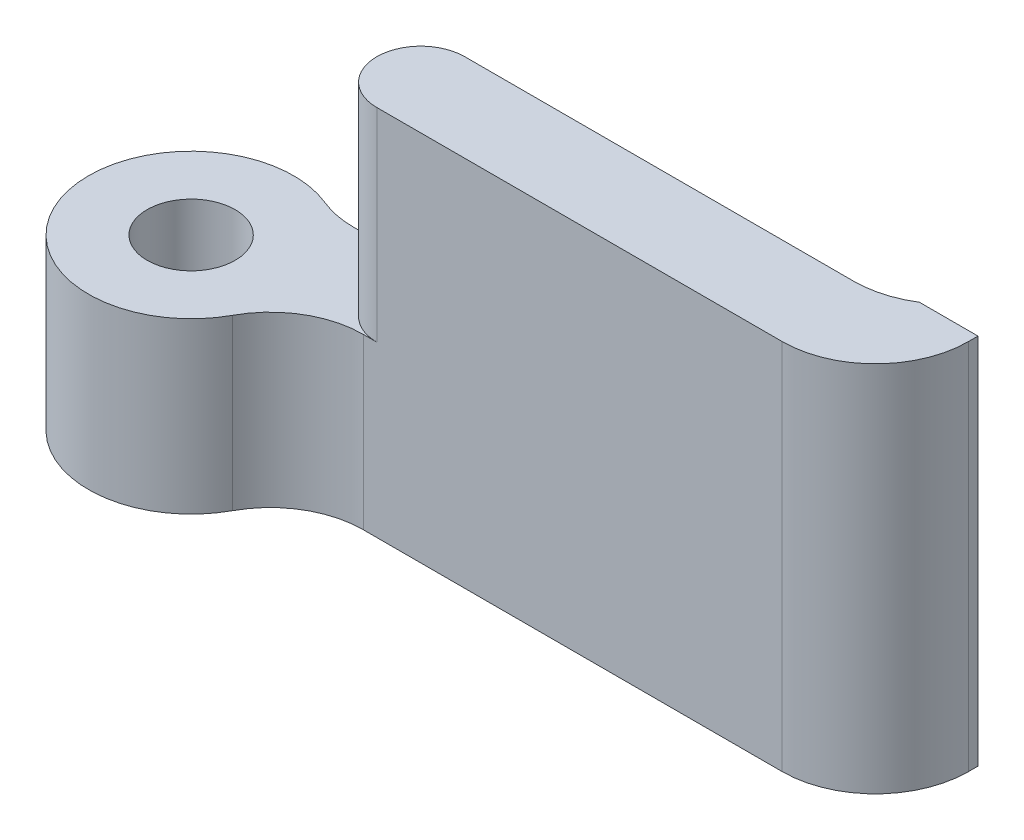
ISO-10303-21;
HEADER;
FILE_DESCRIPTION(('STEP AP214'),'2;1');
FILE_NAME('part.step','',(''),(''),'','','');
FILE_SCHEMA(('AUTOMOTIVE_DESIGN { 1 0 10303 214 1 1 1 1 }'));
ENDSEC;
DATA;
#1=APPLICATION_CONTEXT('core data for automotive mechanical design processes');
#2=APPLICATION_PROTOCOL_DEFINITION('international standard','automotive_design',2000,#1);
#3=PRODUCT_CONTEXT('',#1,'mechanical');
#4=PRODUCT('Part','Part','',(#3));
#5=PRODUCT_RELATED_PRODUCT_CATEGORY('part','',(#4));
#6=PRODUCT_DEFINITION_FORMATION('','',#4);
#7=PRODUCT_DEFINITION_CONTEXT('part definition',#1,'design');
#8=PRODUCT_DEFINITION('design','',#6,#7);
#9=PRODUCT_DEFINITION_SHAPE('','',#8);
#10=(LENGTH_UNIT() NAMED_UNIT(*) SI_UNIT(.MILLI.,.METRE.));
#11=(NAMED_UNIT(*) PLANE_ANGLE_UNIT() SI_UNIT($,.RADIAN.));
#12=(NAMED_UNIT(*) SI_UNIT($,.STERADIAN.) SOLID_ANGLE_UNIT());
#13=UNCERTAINTY_MEASURE_WITH_UNIT(LENGTH_MEASURE(1.E-05),#10,'distance_accuracy_value','');
#14=(GEOMETRIC_REPRESENTATION_CONTEXT(3) GLOBAL_UNCERTAINTY_ASSIGNED_CONTEXT((#13)) GLOBAL_UNIT_ASSIGNED_CONTEXT((#10,
#11,#12)) REPRESENTATION_CONTEXT('',''));
#15=CARTESIAN_POINT('',(0.,0.,0.));
#16=DIRECTION('',(0.,0.,1.));
#17=DIRECTION('',(1.,0.,0.));
#18=AXIS2_PLACEMENT_3D('',#15,#16,#17);
#19=CARTESIAN_POINT('',(-22.0637703059142,12.7,-11.2355470698206));
#20=DIRECTION('',(0.,-1.,0.));
#21=DIRECTION('',(0.,0.,-1.));
#22=AXIS2_PLACEMENT_3D('',#19,#20,#21);
#23=CYLINDRICAL_SURFACE('',#22,3.5);
#24=CARTESIAN_POINT('',(-22.0637703059142,5.77,-11.2355470698206));
#25=DIRECTION('',(0.,-1.,0.));
#26=DIRECTION('',(0.,0.,-1.));
#27=AXIS2_PLACEMENT_3D('',#24,#25,#26);
#28=CIRCLE('',#27,3.5);
#29=CARTESIAN_POINT('',(-18.9850593885621,5.77,-9.57075306233));
#30=VERTEX_POINT('',#29);
#31=CARTESIAN_POINT('',(-20.7346835195554,5.77,-14.4733747851764));
#32=VERTEX_POINT('',#31);
#33=EDGE_CURVE('E174',#30,#32,#28,.T.);
#34=ORIENTED_EDGE('',*,*,#33,.T.);
#35=DIRECTION('',(0.,-1.,0.));
#36=VECTOR('',#35,1.);
#37=CARTESIAN_POINT('',(-20.7346835195554,12.7,-14.4733747851764));
#38=LINE('',#37,#36);
#39=CARTESIAN_POINT('',(-20.7346835195554,0.,-14.4733747851764));
#40=VERTEX_POINT('',#39);
#41=EDGE_CURVE('E210',#32,#40,#38,.T.);
#42=ORIENTED_EDGE('',*,*,#41,.T.);
#43=CARTESIAN_POINT('',(-22.0637703059142,0.,-11.2355470698206));
#44=DIRECTION('',(0.,1.,0.));
#45=DIRECTION('',(0.,0.,1.));
#46=AXIS2_PLACEMENT_3D('',#43,#44,#45);
#47=CIRCLE('',#46,3.5);
#48=CARTESIAN_POINT('',(-18.9850593885621,0.,-9.57075306233));
#49=VERTEX_POINT('',#48);
#50=EDGE_CURVE('E179',#40,#49,#47,.T.);
#51=ORIENTED_EDGE('',*,*,#50,.T.);
#52=DIRECTION('',(0.,-1.,0.));
#53=VECTOR('',#52,1.);
#54=CARTESIAN_POINT('',(-18.9850593885621,12.7,-9.57075306233));
#55=LINE('',#54,#53);
#56=EDGE_CURVE('E208',#49,#30,#55,.F.);
#57=ORIENTED_EDGE('',*,*,#56,.T.);
#58=EDGE_LOOP('',(#34,#42,#51,#57));
#59=FACE_BOUND('',#58,.T.);
#60=ADVANCED_FACE('F35',(#59),#23,.T.);
#61=CARTESIAN_POINT('',(0.,12.7,-11.2355470698207));
#62=DIRECTION('',(0.,0.,-1.));
#63=DIRECTION('',(-1.,0.,0.));
#64=AXIS2_PLACEMENT_3D('',#61,#62,#63);
#65=PLANE('',#64);
#66=DIRECTION('',(1.,0.,0.));
#67=VECTOR('',#66,1.);
#68=CARTESIAN_POINT('',(0.,0.,-11.2355470698207));
#69=LINE('',#68,#67);
#70=CARTESIAN_POINT('',(-16.1922287706784,0.,-11.2355470698206));
#71=VERTEX_POINT('',#70);
#72=CARTESIAN_POINT('',(-1.90855751243395,0.,-11.2355470698207));
#73=VERTEX_POINT('',#72);
#74=EDGE_CURVE('E189',#71,#73,#69,.T.);
#75=ORIENTED_EDGE('',*,*,#74,.T.);
#76=DIRECTION('',(0.,-1.,0.));
#77=VECTOR('',#76,1.);
#78=CARTESIAN_POINT('',(-1.90855751243395,12.7,-11.2355470698207));
#79=LINE('',#78,#77);
#80=CARTESIAN_POINT('',(-1.90855751243395,12.7,-11.2355470698207));
#81=VERTEX_POINT('',#80);
#82=EDGE_CURVE('E204',#73,#81,#79,.F.);
#83=ORIENTED_EDGE('',*,*,#82,.T.);
#84=DIRECTION('',(1.,0.,0.));
#85=VECTOR('',#84,1.);
#86=CARTESIAN_POINT('',(0.,12.7,-11.2355470698207));
#87=LINE('',#86,#85);
#88=CARTESIAN_POINT('',(-15.733557512434,12.7,-11.2355470698206));
#89=VERTEX_POINT('',#88);
#90=EDGE_CURVE('E180',#89,#81,#87,.T.);
#91=ORIENTED_EDGE('',*,*,#90,.F.);
#92=DIRECTION('',(0.,1.,0.));
#93=VECTOR('',#92,1.);
#94=CARTESIAN_POINT('',(-15.733557512434,-15.0292733015078,-11.2355470698206));
#95=LINE('',#94,#93);
#96=CARTESIAN_POINT('',(-15.733557512434,5.77,-11.2355470698206));
#97=VERTEX_POINT('',#96);
#98=EDGE_CURVE('E172',#97,#89,#95,.T.);
#99=ORIENTED_EDGE('',*,*,#98,.F.);
#100=DIRECTION('',(-1.,0.,0.));
#101=VECTOR('',#100,1.);
#102=CARTESIAN_POINT('',(0.,5.77,-11.2355470698207));
#103=LINE('',#102,#101);
#104=CARTESIAN_POINT('',(-16.1922287706784,5.77,-11.2355470698206));
#105=VERTEX_POINT('',#104);
#106=EDGE_CURVE('E176',#97,#105,#103,.T.);
#107=ORIENTED_EDGE('',*,*,#106,.T.);
#108=DIRECTION('',(0.,1.,0.));
#109=VECTOR('',#108,1.);
#110=CARTESIAN_POINT('',(-16.1922287706784,0.,-11.2355470698206));
#111=LINE('',#110,#109);
#112=EDGE_CURVE('E201',#105,#71,#111,.F.);
#113=ORIENTED_EDGE('',*,*,#112,.T.);
#114=EDGE_LOOP('',(#75,#83,#91,#99,#107,#113));
#115=FACE_BOUND('',#114,.T.);
#116=ADVANCED_FACE('F231',(#115),#65,.F.);
#117=CARTESIAN_POINT('',(1.26644248756605,12.7,0.));
#118=DIRECTION('',(-1.,0.,0.));
#119=DIRECTION('',(0.,0.,1.));
#120=AXIS2_PLACEMENT_3D('',#117,#118,#119);
#121=PLANE('',#120);
#122=DIRECTION('',(0.,0.,-1.));
#123=VECTOR('',#122,1.);
#124=CARTESIAN_POINT('',(1.26644248756605,12.7,0.));
#125=LINE('',#124,#123);
#126=CARTESIAN_POINT('',(1.26644248756605,12.7,-14.4105470698207));
#127=VERTEX_POINT('',#126);
#128=CARTESIAN_POINT('',(1.26644248756605,12.7,-14.7355470698207));
#129=VERTEX_POINT('',#128);
#130=EDGE_CURVE('E142',#127,#129,#125,.T.);
#131=ORIENTED_EDGE('',*,*,#130,.F.);
#132=DIRECTION('',(0.,-1.,0.));
#133=VECTOR('',#132,1.);
#134=CARTESIAN_POINT('',(1.26644248756605,12.7,-14.4105470698207));
#135=LINE('',#134,#133);
#136=CARTESIAN_POINT('',(1.26644248756605,0.,-14.4105470698207));
#137=VERTEX_POINT('',#136);
#138=EDGE_CURVE('E196',#127,#137,#135,.T.);
#139=ORIENTED_EDGE('',*,*,#138,.T.);
#140=DIRECTION('',(0.,0.,-1.));
#141=VECTOR('',#140,1.);
#142=CARTESIAN_POINT('',(1.26644248756605,0.,0.));
#143=LINE('',#142,#141);
#144=CARTESIAN_POINT('',(1.26644248756605,0.,-14.7355470698207));
#145=VERTEX_POINT('',#144);
#146=EDGE_CURVE('E192',#137,#145,#143,.T.);
#147=ORIENTED_EDGE('',*,*,#146,.T.);
#148=DIRECTION('',(0.,1.,0.));
#149=VECTOR('',#148,1.);
#150=CARTESIAN_POINT('',(1.26644248756605,-3.77253374436471,-14.7355470698207));
#151=LINE('',#150,#149);
#152=EDGE_CURVE('E152',#145,#129,#151,.T.);
#153=ORIENTED_EDGE('',*,*,#152,.T.);
#154=EDGE_LOOP('',(#131,#139,#147,#153));
#155=FACE_BOUND('',#154,.T.);
#156=ADVANCED_FACE('F242',(#155),#121,.F.);
#157=CARTESIAN_POINT('',(0.,12.7,-14.2355470698207));
#158=DIRECTION('',(0.,0.,1.));
#159=DIRECTION('',(1.,0.,0.));
#160=AXIS2_PLACEMENT_3D('',#157,#158,#159);
#161=PLANE('',#160);
#162=CARTESIAN_POINT('',(-4.73355751243397,6.35,-14.2355470698207));
#163=DIRECTION('',(0.,0.,-1.));
#164=DIRECTION('',(-1.,0.,0.));
#165=AXIS2_PLACEMENT_3D('',#162,#163,#164);
#166=CIRCLE('',#165,1.585);
#167=CARTESIAN_POINT('',(-6.31855751243397,6.35,-14.2355470698207));
#168=VERTEX_POINT('',#167);
#169=EDGE_CURVE('E147',#168,#168,#166,.T.);
#170=ORIENTED_EDGE('',*,*,#169,.F.);
#171=EDGE_LOOP('',(#170));
#172=FACE_BOUND('',#171,.T.);
#173=DIRECTION('',(-1.,0.,0.));
#174=VECTOR('',#173,1.);
#175=CARTESIAN_POINT('',(0.,0.,-14.2355470698207));
#176=LINE('',#175,#174);
#177=CARTESIAN_POINT('',(-2.47281022552656,0.,-14.2355470698207));
#178=VERTEX_POINT('',#177);
#179=CARTESIAN_POINT('',(-19.529011934787,0.,-14.2355470698206));
#180=VERTEX_POINT('',#179);
#181=EDGE_CURVE('E182',#178,#180,#176,.T.);
#182=ORIENTED_EDGE('',*,*,#181,.T.);
#183=DIRECTION('',(0.,1.,0.));
#184=VECTOR('',#183,1.);
#185=CARTESIAN_POINT('',(-19.529011934787,5.77,-14.2355470698206));
#186=LINE('',#185,#184);
#187=CARTESIAN_POINT('',(-19.529011934787,5.77,-14.2355470698206));
#188=VERTEX_POINT('',#187);
#189=EDGE_CURVE('E50',#180,#188,#186,.T.);
#190=ORIENTED_EDGE('',*,*,#189,.T.);
#191=DIRECTION('',(1.,0.,0.));
#192=VECTOR('',#191,1.);
#193=CARTESIAN_POINT('',(0.,5.77,-14.2355470698207));
#194=LINE('',#193,#192);
#195=CARTESIAN_POINT('',(-15.733557512434,5.77,-14.2355470698206));
#196=VERTEX_POINT('',#195);
#197=EDGE_CURVE('E186',#188,#196,#194,.T.);
#198=ORIENTED_EDGE('',*,*,#197,.T.);
#199=DIRECTION('',(0.,1.,0.));
#200=VECTOR('',#199,1.);
#201=CARTESIAN_POINT('',(-15.733557512434,-15.0292733015078,-14.2355470698206));
#202=LINE('',#201,#200);
#203=CARTESIAN_POINT('',(-15.733557512434,12.7,-14.2355470698206));
#204=VERTEX_POINT('',#203);
#205=EDGE_CURVE('E169',#196,#204,#202,.T.);
#206=ORIENTED_EDGE('',*,*,#205,.T.);
#207=DIRECTION('',(-1.,0.,0.));
#208=VECTOR('',#207,1.);
#209=CARTESIAN_POINT('',(0.,12.7,-14.2355470698207));
#210=LINE('',#209,#208);
#211=CARTESIAN_POINT('',(-2.47281022552656,12.7,-14.2355470698207));
#212=VERTEX_POINT('',#211);
#213=EDGE_CURVE('E184',#212,#204,#210,.T.);
#214=ORIENTED_EDGE('',*,*,#213,.F.);
#215=DIRECTION('',(0.,1.,0.));
#216=VECTOR('',#215,1.);
#217=CARTESIAN_POINT('',(-2.47281022552656,-3.77253374436471,-14.2355470698207));
#218=LINE('',#217,#216);
#219=EDGE_CURVE('E130',#178,#212,#218,.T.);
#220=ORIENTED_EDGE('',*,*,#219,.F.);
#221=EDGE_LOOP('',(#182,#190,#198,#206,#214,#220));
#222=FACE_BOUND('',#221,.T.);
#223=ADVANCED_FACE('F238',(#172,#222),#161,.F.);
#224=CARTESIAN_POINT('',(0.,12.7,0.));
#225=DIRECTION('',(0.,1.,0.));
#226=DIRECTION('',(0.,0.,1.));
#227=AXIS2_PLACEMENT_3D('',#224,#225,#226);
#228=PLANE('',#227);
#229=ORIENTED_EDGE('',*,*,#90,.T.);
#230=CARTESIAN_POINT('',(-1.90855751243395,12.7,-14.4105470698207));
#231=DIRECTION('',(0.,1.,0.));
#232=DIRECTION('',(0.,0.,1.));
#233=AXIS2_PLACEMENT_3D('',#230,#231,#232);
#234=CIRCLE('',#233,3.175);
#235=EDGE_CURVE('E206',#81,#127,#234,.T.);
#236=ORIENTED_EDGE('',*,*,#235,.T.);
#237=ORIENTED_EDGE('',*,*,#130,.T.);
#238=DIRECTION('',(-1.,0.,0.));
#239=VECTOR('',#238,1.);
#240=CARTESIAN_POINT('',(0.,12.7,-14.7355470698207));
#241=LINE('',#240,#239);
#242=CARTESIAN_POINT('',(-0.73355751243395,12.7,-14.7355470698207));
#243=VERTEX_POINT('',#242);
#244=EDGE_CURVE('E125',#129,#243,#241,.T.);
#245=ORIENTED_EDGE('',*,*,#244,.T.);
#246=CARTESIAN_POINT('',(-2.47281022552656,12.7,-17.5105470698206));
#247=DIRECTION('',(0.,1.,0.));
#248=DIRECTION('',(0.,0.,1.));
#249=AXIS2_PLACEMENT_3D('',#246,#247,#248);
#250=CIRCLE('',#249,3.275);
#251=EDGE_CURVE('E131',#243,#212,#250,.F.);
#252=ORIENTED_EDGE('',*,*,#251,.T.);
#253=ORIENTED_EDGE('',*,*,#213,.T.);
#254=CARTESIAN_POINT('',(-15.733557512434,12.7,-12.7355470698206));
#255=DIRECTION('',(0.,1.,0.));
#256=DIRECTION('',(0.,0.,1.));
#257=AXIS2_PLACEMENT_3D('',#254,#255,#256);
#258=CIRCLE('',#257,1.5);
#259=EDGE_CURVE('E161',#89,#204,#258,.F.);
#260=ORIENTED_EDGE('',*,*,#259,.F.);
#261=EDGE_LOOP('',(#229,#236,#237,#245,#252,#253,#260));
#262=FACE_BOUND('',#261,.T.);
#263=ADVANCED_FACE('F140',(#262),#228,.T.);
#264=CARTESIAN_POINT('',(0.,0.,0.));
#265=DIRECTION('',(0.,1.,0.));
#266=DIRECTION('',(0.,0.,1.));
#267=AXIS2_PLACEMENT_3D('',#264,#265,#266);
#268=PLANE('',#267);
#269=CARTESIAN_POINT('',(-22.0637703059142,0.,-11.2355470698206));
#270=DIRECTION('',(0.,1.,0.));
#271=DIRECTION('',(0.,0.,1.));
#272=AXIS2_PLACEMENT_3D('',#269,#270,#271);
#273=CIRCLE('',#272,1.5);
#274=CARTESIAN_POINT('',(-22.0637703059142,0.,-9.73554706982062));
#275=VERTEX_POINT('',#274);
#276=EDGE_CURVE('E158',#275,#275,#273,.T.);
#277=ORIENTED_EDGE('',*,*,#276,.T.);
#278=EDGE_LOOP('',(#277));
#279=FACE_BOUND('',#278,.T.);
#280=ORIENTED_EDGE('',*,*,#146,.F.);
#281=CARTESIAN_POINT('',(-1.90855751243395,0.,-14.4105470698207));
#282=DIRECTION('',(0.,1.,0.));
#283=DIRECTION('',(0.,0.,1.));
#284=AXIS2_PLACEMENT_3D('',#281,#282,#283);
#285=CIRCLE('',#284,3.175);
#286=EDGE_CURVE('E199',#137,#73,#285,.F.);
#287=ORIENTED_EDGE('',*,*,#286,.T.);
#288=ORIENTED_EDGE('',*,*,#74,.F.);
#289=CARTESIAN_POINT('',(-16.1922287706784,0.,-8.06054706982065));
#290=DIRECTION('',(0.,1.,0.));
#291=DIRECTION('',(0.,0.,1.));
#292=AXIS2_PLACEMENT_3D('',#289,#290,#291);
#293=CIRCLE('',#292,3.175);
#294=EDGE_CURVE('E43',#71,#49,#293,.T.);
#295=ORIENTED_EDGE('',*,*,#294,.T.);
#296=ORIENTED_EDGE('',*,*,#50,.F.);
#297=CARTESIAN_POINT('',(-19.529011934787,0.,-17.4105470698206));
#298=DIRECTION('',(0.,1.,0.));
#299=DIRECTION('',(0.,0.,1.));
#300=AXIS2_PLACEMENT_3D('',#297,#298,#299);
#301=CIRCLE('',#300,3.175);
#302=EDGE_CURVE('E214',#40,#180,#301,.T.);
#303=ORIENTED_EDGE('',*,*,#302,.T.);
#304=ORIENTED_EDGE('',*,*,#181,.F.);
#305=CARTESIAN_POINT('',(-2.47281022552656,0.,-17.5105470698206));
#306=DIRECTION('',(0.,1.,0.));
#307=DIRECTION('',(0.,0.,1.));
#308=AXIS2_PLACEMENT_3D('',#305,#306,#307);
#309=CIRCLE('',#308,3.275);
#310=CARTESIAN_POINT('',(-0.73355751243395,0.,-14.7355470698207));
#311=VERTEX_POINT('',#310);
#312=EDGE_CURVE('E155',#178,#311,#309,.T.);
#313=ORIENTED_EDGE('',*,*,#312,.T.);
#314=DIRECTION('',(1.,0.,0.));
#315=VECTOR('',#314,1.);
#316=CARTESIAN_POINT('',(0.,0.,-14.7355470698207));
#317=LINE('',#316,#315);
#318=EDGE_CURVE('E127',#311,#145,#317,.T.);
#319=ORIENTED_EDGE('',*,*,#318,.T.);
#320=EDGE_LOOP('',(#280,#287,#288,#295,#296,#303,#304,#313,#319));
#321=FACE_BOUND('',#320,.T.);
#322=ADVANCED_FACE('F220',(#279,#321),#268,.F.);
#323=CARTESIAN_POINT('',(-22.0637703059142,5.77,-11.2355470698206));
#324=DIRECTION('',(0.,-1.,0.));
#325=DIRECTION('',(-0.707106781186548,0.,-0.707106781186547));
#326=AXIS2_PLACEMENT_3D('',#323,#324,#325);
#327=PLANE('',#326);
#328=CARTESIAN_POINT('',(-22.0637703059142,5.77,-11.2355470698206));
#329=DIRECTION('',(0.,1.,0.));
#330=DIRECTION('',(0.,0.,1.));
#331=AXIS2_PLACEMENT_3D('',#328,#329,#330);
#332=CIRCLE('',#331,1.5);
#333=CARTESIAN_POINT('',(-22.0637703059142,5.77,-9.73554706982062));
#334=VERTEX_POINT('',#333);
#335=EDGE_CURVE('E157',#334,#334,#332,.T.);
#336=ORIENTED_EDGE('',*,*,#335,.F.);
#337=EDGE_LOOP('',(#336));
#338=FACE_BOUND('',#337,.T.);
#339=CARTESIAN_POINT('',(-15.733557512434,5.77,-12.7355470698206));
#340=DIRECTION('',(0.,-1.,0.));
#341=DIRECTION('',(0.,0.,-1.));
#342=AXIS2_PLACEMENT_3D('',#339,#340,#341);
#343=CIRCLE('',#342,1.5);
#344=EDGE_CURVE('E166',#97,#196,#343,.T.);
#345=ORIENTED_EDGE('',*,*,#344,.T.);
#346=ORIENTED_EDGE('',*,*,#197,.F.);
#347=CARTESIAN_POINT('',(-19.529011934787,5.77,-17.4105470698206));
#348=DIRECTION('',(0.,-1.,0.));
#349=DIRECTION('',(0.,0.,-1.));
#350=AXIS2_PLACEMENT_3D('',#347,#348,#349);
#351=CIRCLE('',#350,3.175);
#352=EDGE_CURVE('E57',#188,#32,#351,.T.);
#353=ORIENTED_EDGE('',*,*,#352,.T.);
#354=ORIENTED_EDGE('',*,*,#33,.F.);
#355=CARTESIAN_POINT('',(-16.1922287706784,5.77,-8.06054706982065));
#356=DIRECTION('',(0.,-1.,0.));
#357=DIRECTION('',(0.,0.,-1.));
#358=AXIS2_PLACEMENT_3D('',#355,#356,#357);
#359=CIRCLE('',#358,3.175);
#360=EDGE_CURVE('E11',#30,#105,#359,.T.);
#361=ORIENTED_EDGE('',*,*,#360,.T.);
#362=ORIENTED_EDGE('',*,*,#106,.F.);
#363=EDGE_LOOP('',(#345,#346,#353,#354,#361,#362));
#364=FACE_BOUND('',#363,.T.);
#365=ADVANCED_FACE('F227',(#338,#364),#327,.F.);
#366=CARTESIAN_POINT('',(-15.733557512434,-15.0292733015078,-12.7355470698206));
#367=DIRECTION('',(0.,1.,0.));
#368=DIRECTION('',(0.,0.,1.));
#369=AXIS2_PLACEMENT_3D('',#366,#367,#368);
#370=CYLINDRICAL_SURFACE('',#369,1.5);
#371=ORIENTED_EDGE('',*,*,#98,.T.);
#372=ORIENTED_EDGE('',*,*,#259,.T.);
#373=ORIENTED_EDGE('',*,*,#205,.F.);
#374=ORIENTED_EDGE('',*,*,#344,.F.);
#375=EDGE_LOOP('',(#371,#372,#373,#374));
#376=FACE_BOUND('',#375,.T.);
#377=ADVANCED_FACE('F235',(#376),#370,.T.);
#378=CARTESIAN_POINT('',(-22.0637703059142,0.,-11.2355470698206));
#379=DIRECTION('',(0.,1.,0.));
#380=DIRECTION('',(0.,0.,1.));
#381=AXIS2_PLACEMENT_3D('',#378,#379,#380);
#382=CYLINDRICAL_SURFACE('',#381,1.5);
#383=ORIENTED_EDGE('',*,*,#276,.F.);
#384=EDGE_LOOP('',(#383));
#385=FACE_BOUND('',#384,.T.);
#386=ORIENTED_EDGE('',*,*,#335,.T.);
#387=EDGE_LOOP('',(#386));
#388=FACE_BOUND('',#387,.T.);
#389=ADVANCED_FACE('F276',(#385,#388),#382,.F.);
#390=CARTESIAN_POINT('',(0.,-3.77253374436471,-14.7355470698207));
#391=DIRECTION('',(0.,0.,-1.));
#392=DIRECTION('',(-1.,0.,0.));
#393=AXIS2_PLACEMENT_3D('',#390,#391,#392);
#394=PLANE('',#393);
#395=ORIENTED_EDGE('',*,*,#318,.F.);
#396=DIRECTION('',(0.,1.,0.));
#397=VECTOR('',#396,1.);
#398=CARTESIAN_POINT('',(-0.73355751243395,-3.77253374436471,-14.7355470698207));
#399=LINE('',#398,#397);
#400=EDGE_CURVE('E120',#311,#243,#399,.T.);
#401=ORIENTED_EDGE('',*,*,#400,.T.);
#402=ORIENTED_EDGE('',*,*,#244,.F.);
#403=ORIENTED_EDGE('',*,*,#152,.F.);
#404=EDGE_LOOP('',(#395,#401,#402,#403));
#405=FACE_BOUND('',#404,.T.);
#406=ADVANCED_FACE('F122',(#405),#394,.T.);
#407=CARTESIAN_POINT('',(-2.47281022552656,-3.77253374436471,-17.5105470698206));
#408=DIRECTION('',(0.,1.,0.));
#409=DIRECTION('',(0.,0.,1.));
#410=AXIS2_PLACEMENT_3D('',#407,#408,#409);
#411=CYLINDRICAL_SURFACE('',#410,3.275);
#412=ORIENTED_EDGE('',*,*,#312,.F.);
#413=ORIENTED_EDGE('',*,*,#219,.T.);
#414=ORIENTED_EDGE('',*,*,#251,.F.);
#415=ORIENTED_EDGE('',*,*,#400,.F.);
#416=EDGE_LOOP('',(#412,#413,#414,#415));
#417=FACE_BOUND('',#416,.T.);
#418=ADVANCED_FACE('F135',(#417),#411,.F.);
#419=CARTESIAN_POINT('',(-1.90855751243395,12.7,-14.4105470698207));
#420=DIRECTION('',(0.,-1.,0.));
#421=DIRECTION('',(0.,0.,-1.));
#422=AXIS2_PLACEMENT_3D('',#419,#420,#421);
#423=CYLINDRICAL_SURFACE('',#422,3.175);
#424=ORIENTED_EDGE('',*,*,#235,.F.);
#425=ORIENTED_EDGE('',*,*,#82,.F.);
#426=ORIENTED_EDGE('',*,*,#286,.F.);
#427=ORIENTED_EDGE('',*,*,#138,.F.);
#428=EDGE_LOOP('',(#424,#425,#426,#427));
#429=FACE_BOUND('',#428,.T.);
#430=ADVANCED_FACE('F245',(#429),#423,.T.);
#431=CARTESIAN_POINT('',(-19.529011934787,12.7,-17.4105470698206));
#432=DIRECTION('',(0.,-1.,0.));
#433=DIRECTION('',(0.,0.,-1.));
#434=AXIS2_PLACEMENT_3D('',#431,#432,#433);
#435=CYLINDRICAL_SURFACE('',#434,3.175);
#436=ORIENTED_EDGE('',*,*,#352,.F.);
#437=ORIENTED_EDGE('',*,*,#189,.F.);
#438=ORIENTED_EDGE('',*,*,#302,.F.);
#439=ORIENTED_EDGE('',*,*,#41,.F.);
#440=EDGE_LOOP('',(#436,#437,#438,#439));
#441=FACE_BOUND('',#440,.T.);
#442=ADVANCED_FACE('F240',(#441),#435,.F.);
#443=CARTESIAN_POINT('',(-16.1922287706784,12.7,-8.06054706982065));
#444=DIRECTION('',(0.,-1.,0.));
#445=DIRECTION('',(0.,0.,-1.));
#446=AXIS2_PLACEMENT_3D('',#443,#444,#445);
#447=CYLINDRICAL_SURFACE('',#446,3.175);
#448=ORIENTED_EDGE('',*,*,#360,.F.);
#449=ORIENTED_EDGE('',*,*,#56,.F.);
#450=ORIENTED_EDGE('',*,*,#294,.F.);
#451=ORIENTED_EDGE('',*,*,#112,.F.);
#452=EDGE_LOOP('',(#448,#449,#450,#451));
#453=FACE_BOUND('',#452,.T.);
#454=ADVANCED_FACE('F37',(#453),#447,.F.);
#455=CARTESIAN_POINT('',(-4.73355751243397,6.35,-12.7355470698207));
#456=DIRECTION('',(0.,0.,-1.));
#457=DIRECTION('',(-1.,0.,0.));
#458=AXIS2_PLACEMENT_3D('',#455,#456,#457);
#459=CYLINDRICAL_SURFACE('',#458,1.585);
#460=CARTESIAN_POINT('',(-4.73355751243397,6.35,-12.7355470698207));
#461=DIRECTION('',(0.,0.,-1.));
#462=DIRECTION('',(-1.,0.,0.));
#463=AXIS2_PLACEMENT_3D('',#460,#461,#462);
#464=CIRCLE('',#463,1.585);
#465=CARTESIAN_POINT('',(-6.31855751243397,6.35,-12.7355470698207));
#466=VERTEX_POINT('',#465);
#467=EDGE_CURVE('E144',#466,#466,#464,.T.);
#468=ORIENTED_EDGE('',*,*,#467,.F.);
#469=EDGE_LOOP('',(#468));
#470=FACE_BOUND('',#469,.T.);
#471=ORIENTED_EDGE('',*,*,#169,.T.);
#472=EDGE_LOOP('',(#471));
#473=FACE_BOUND('',#472,.T.);
#474=ADVANCED_FACE('F282',(#470,#473),#459,.F.);
#475=CARTESIAN_POINT('',(-4.73355751243397,6.35,-12.7355470698207));
#476=DIRECTION('',(0.,0.,-1.));
#477=DIRECTION('',(-1.,0.,0.));
#478=AXIS2_PLACEMENT_3D('',#475,#476,#477);
#479=PLANE('',#478);
#480=ORIENTED_EDGE('',*,*,#467,.T.);
#481=EDGE_LOOP('',(#480));
#482=FACE_BOUND('',#481,.T.);
#483=ADVANCED_FACE('F285',(#482),#479,.T.);
#484=CLOSED_SHELL('',(#60,#116,#156,#223,#263,#322,#365,#377,#389,#406,#418,#430,#442,#454,#474,#483));
#485=MANIFOLD_SOLID_BREP('B2',#484);
#486=ADVANCED_BREP_SHAPE_REPRESENTATION('',(#18,#485),#14);
#487=SHAPE_DEFINITION_REPRESENTATION(#9,#486);
ENDSEC;
END-ISO-10303-21;
